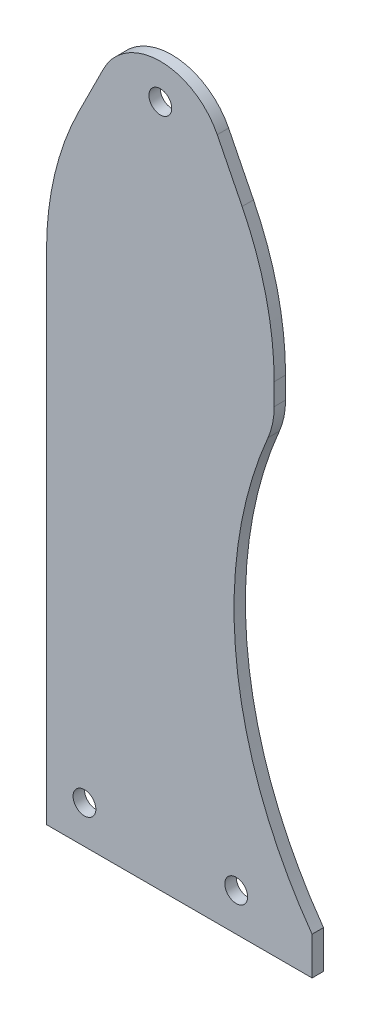
ISO-10303-21;
HEADER;
FILE_DESCRIPTION(('STEP AP214'),'2;1');
FILE_NAME('part.step','',(''),(''),'','','');
FILE_SCHEMA(('AUTOMOTIVE_DESIGN { 1 0 10303 214 1 1 1 1 }'));
ENDSEC;
DATA;
#1=APPLICATION_CONTEXT('core data for automotive mechanical design processes');
#2=APPLICATION_PROTOCOL_DEFINITION('international standard','automotive_design',2000,#1);
#3=PRODUCT_CONTEXT('',#1,'mechanical');
#4=PRODUCT('Part','Part','',(#3));
#5=PRODUCT_RELATED_PRODUCT_CATEGORY('part','',(#4));
#6=PRODUCT_DEFINITION_FORMATION('','',#4);
#7=PRODUCT_DEFINITION_CONTEXT('part definition',#1,'design');
#8=PRODUCT_DEFINITION('design','',#6,#7);
#9=PRODUCT_DEFINITION_SHAPE('','',#8);
#10=(LENGTH_UNIT() NAMED_UNIT(*) SI_UNIT(.MILLI.,.METRE.));
#11=(NAMED_UNIT(*) PLANE_ANGLE_UNIT() SI_UNIT($,.RADIAN.));
#12=(NAMED_UNIT(*) SI_UNIT($,.STERADIAN.) SOLID_ANGLE_UNIT());
#13=UNCERTAINTY_MEASURE_WITH_UNIT(LENGTH_MEASURE(1.E-05),#10,'distance_accuracy_value','');
#14=(GEOMETRIC_REPRESENTATION_CONTEXT(3) GLOBAL_UNCERTAINTY_ASSIGNED_CONTEXT((#13)) GLOBAL_UNIT_ASSIGNED_CONTEXT((#10,
#11,#12)) REPRESENTATION_CONTEXT('',''));
#15=CARTESIAN_POINT('',(0.,0.,0.));
#16=DIRECTION('',(0.,0.,1.));
#17=DIRECTION('',(1.,0.,0.));
#18=AXIS2_PLACEMENT_3D('',#15,#16,#17);
#19=CARTESIAN_POINT('',(-20.,131.114561800017,3.));
#20=DIRECTION('',(0.,0.,1.));
#21=DIRECTION('',(1.,0.,0.));
#22=AXIS2_PLACEMENT_3D('',#19,#20,#21);
#23=PLANE('',#22);
#24=CARTESIAN_POINT('',(50.,10.,3.));
#25=DIRECTION('',(0.,0.,1.));
#26=DIRECTION('',(-1.,0.,0.));
#27=AXIS2_PLACEMENT_3D('',#24,#25,#26);
#28=CIRCLE('',#27,3.);
#29=CARTESIAN_POINT('',(47.,10.,3.));
#30=VERTEX_POINT('',#29);
#31=EDGE_CURVE('E278',#30,#30,#28,.T.);
#32=ORIENTED_EDGE('',*,*,#31,.F.);
#33=EDGE_LOOP('',(#32));
#34=FACE_BOUND('',#33,.T.);
#35=CARTESIAN_POINT('',(-20.,131.114561800017,3.));
#36=DIRECTION('',(0.,0.,1.));
#37=DIRECTION('',(1.,0.,0.));
#38=AXIS2_PLACEMENT_3D('',#35,#36,#37);
#39=CIRCLE('',#38,80.);
#40=CARTESIAN_POINT('',(60.,131.114561800017,3.));
#41=VERTEX_POINT('',#40);
#42=CARTESIAN_POINT('',(51.5541752799933,166.891649440013,3.));
#43=VERTEX_POINT('',#42);
#44=EDGE_CURVE('E176',#41,#43,#39,.T.);
#45=ORIENTED_EDGE('',*,*,#44,.T.);
#46=DIRECTION('',(-0.447213595499959,0.894427190999915,0.));
#47=VECTOR('',#46,1.);
#48=CARTESIAN_POINT('',(51.5541752799933,166.891649440013,3.));
#49=LINE('',#48,#47);
#50=CARTESIAN_POINT('',(45.,180.,3.));
#51=VERTEX_POINT('',#50);
#52=EDGE_CURVE('E107',#43,#51,#49,.T.);
#53=ORIENTED_EDGE('',*,*,#52,.T.);
#54=CARTESIAN_POINT('',(30.,172.5,3.));
#55=DIRECTION('',(0.,0.,1.));
#56=DIRECTION('',(-1.,0.,0.));
#57=AXIS2_PLACEMENT_3D('',#54,#55,#56);
#58=CIRCLE('',#57,16.7705098312484);
#59=CARTESIAN_POINT('',(15.,180.,3.));
#60=VERTEX_POINT('',#59);
#61=EDGE_CURVE('E200',#51,#60,#58,.T.);
#62=ORIENTED_EDGE('',*,*,#61,.T.);
#63=DIRECTION('',(-0.447213595499956,-0.894427190999917,0.));
#64=VECTOR('',#63,1.);
#65=CARTESIAN_POINT('',(8.44582472000673,166.891649440013,3.));
#66=LINE('',#65,#64);
#67=CARTESIAN_POINT('',(8.4458247200067,166.891649440013,3.));
#68=VERTEX_POINT('',#67);
#69=EDGE_CURVE('E218',#60,#68,#66,.T.);
#70=ORIENTED_EDGE('',*,*,#69,.T.);
#71=CARTESIAN_POINT('',(80.,131.114561800017,3.));
#72=DIRECTION('',(0.,0.,1.));
#73=DIRECTION('',(-1.,0.,0.));
#74=AXIS2_PLACEMENT_3D('',#71,#72,#73);
#75=CIRCLE('',#74,80.);
#76=CARTESIAN_POINT('',(0.,131.114561800017,3.));
#77=VERTEX_POINT('',#76);
#78=EDGE_CURVE('E215',#68,#77,#75,.T.);
#79=ORIENTED_EDGE('',*,*,#78,.T.);
#80=DIRECTION('',(0.,-1.,0.));
#81=VECTOR('',#80,1.);
#82=CARTESIAN_POINT('',(0.,131.114561800017,3.));
#83=LINE('',#82,#81);
#84=CARTESIAN_POINT('',(0.,0.,3.));
#85=VERTEX_POINT('',#84);
#86=EDGE_CURVE('E217',#77,#85,#83,.T.);
#87=ORIENTED_EDGE('',*,*,#86,.T.);
#88=DIRECTION('',(1.,0.,0.));
#89=VECTOR('',#88,1.);
#90=CARTESIAN_POINT('',(0.,0.,3.));
#91=LINE('',#90,#89);
#92=CARTESIAN_POINT('',(70.,0.,3.));
#93=VERTEX_POINT('',#92);
#94=EDGE_CURVE('E220',#85,#93,#91,.T.);
#95=ORIENTED_EDGE('',*,*,#94,.T.);
#96=DIRECTION('',(0.,1.,0.));
#97=VECTOR('',#96,1.);
#98=CARTESIAN_POINT('',(70.,0.,3.));
#99=LINE('',#98,#97);
#100=CARTESIAN_POINT('',(70.,9.99999999999995,3.));
#101=VERTEX_POINT('',#100);
#102=EDGE_CURVE('E135',#93,#101,#99,.T.);
#103=ORIENTED_EDGE('',*,*,#102,.T.);
#104=CARTESIAN_POINT('',(159.42548401335,74.0553105447004,3.));
#105=DIRECTION('',(0.,0.,-1.));
#106=DIRECTION('',(-1.,0.,0.));
#107=AXIS2_PLACEMENT_3D('',#104,#105,#106);
#108=CIRCLE('',#107,110.);
#109=CARTESIAN_POINT('',(58.3731513866693,117.511335106395,3.));
#110=VERTEX_POINT('',#109);
#111=EDGE_CURVE('E129',#101,#110,#108,.T.);
#112=ORIENTED_EDGE('',*,*,#111,.T.);
#113=CARTESIAN_POINT('',(40.,125.412430481248,3.));
#114=DIRECTION('',(0.,0.,1.));
#115=DIRECTION('',(1.,0.,0.));
#116=AXIS2_PLACEMENT_3D('',#113,#114,#115);
#117=CIRCLE('',#116,20.);
#118=CARTESIAN_POINT('',(60.,125.412430481248,3.));
#119=VERTEX_POINT('',#118);
#120=EDGE_CURVE('E133',#110,#119,#117,.T.);
#121=ORIENTED_EDGE('',*,*,#120,.T.);
#122=DIRECTION('',(0.,1.,0.));
#123=VECTOR('',#122,1.);
#124=CARTESIAN_POINT('',(60.,131.114561800017,3.));
#125=LINE('',#124,#123);
#126=EDGE_CURVE('E55',#119,#41,#125,.T.);
#127=ORIENTED_EDGE('',*,*,#126,.T.);
#128=EDGE_LOOP('',(#45,#53,#62,#70,#79,#87,#95,#103,#112,#121,#127));
#129=FACE_BOUND('',#128,.T.);
#130=CARTESIAN_POINT('',(10.,10.,3.));
#131=DIRECTION('',(0.,0.,1.));
#132=DIRECTION('',(1.,0.,0.));
#133=AXIS2_PLACEMENT_3D('',#130,#131,#132);
#134=CIRCLE('',#133,3.);
#135=CARTESIAN_POINT('',(13.,10.,3.));
#136=VERTEX_POINT('',#135);
#137=EDGE_CURVE('E157',#136,#136,#134,.T.);
#138=ORIENTED_EDGE('',*,*,#137,.F.);
#139=EDGE_LOOP('',(#138));
#140=FACE_BOUND('',#139,.T.);
#141=CARTESIAN_POINT('',(30.,180.,3.));
#142=DIRECTION('',(0.,0.,1.));
#143=DIRECTION('',(1.,0.,0.));
#144=AXIS2_PLACEMENT_3D('',#141,#142,#143);
#145=CIRCLE('',#144,3.);
#146=CARTESIAN_POINT('',(33.,180.,3.));
#147=VERTEX_POINT('',#146);
#148=EDGE_CURVE('E269',#147,#147,#145,.T.);
#149=ORIENTED_EDGE('',*,*,#148,.F.);
#150=EDGE_LOOP('',(#149));
#151=FACE_BOUND('',#150,.T.);
#152=ADVANCED_FACE('F38',(#34,#129,#140,#151),#23,.T.);
#153=CARTESIAN_POINT('',(-20.,131.114561800017,0.));
#154=DIRECTION('',(0.,0.,1.));
#155=DIRECTION('',(1.,0.,0.));
#156=AXIS2_PLACEMENT_3D('',#153,#154,#155);
#157=PLANE('',#156);
#158=CARTESIAN_POINT('',(50.,10.,0.));
#159=DIRECTION('',(0.,0.,1.));
#160=DIRECTION('',(-1.,0.,0.));
#161=AXIS2_PLACEMENT_3D('',#158,#159,#160);
#162=CIRCLE('',#161,3.);
#163=CARTESIAN_POINT('',(47.,10.,0.));
#164=VERTEX_POINT('',#163);
#165=EDGE_CURVE('E275',#164,#164,#162,.T.);
#166=ORIENTED_EDGE('',*,*,#165,.T.);
#167=EDGE_LOOP('',(#166));
#168=FACE_BOUND('',#167,.T.);
#169=CARTESIAN_POINT('',(-20.,131.114561800017,0.));
#170=DIRECTION('',(0.,0.,1.));
#171=DIRECTION('',(1.,0.,0.));
#172=AXIS2_PLACEMENT_3D('',#169,#170,#171);
#173=CIRCLE('',#172,80.);
#174=CARTESIAN_POINT('',(60.,131.114561800017,0.));
#175=VERTEX_POINT('',#174);
#176=CARTESIAN_POINT('',(51.5541752799933,166.891649440013,0.));
#177=VERTEX_POINT('',#176);
#178=EDGE_CURVE('E153',#175,#177,#173,.T.);
#179=ORIENTED_EDGE('',*,*,#178,.F.);
#180=DIRECTION('',(0.,1.,0.));
#181=VECTOR('',#180,1.);
#182=CARTESIAN_POINT('',(60.,131.114561800017,0.));
#183=LINE('',#182,#181);
#184=CARTESIAN_POINT('',(60.,125.412430481248,0.));
#185=VERTEX_POINT('',#184);
#186=EDGE_CURVE('E99',#185,#175,#183,.T.);
#187=ORIENTED_EDGE('',*,*,#186,.F.);
#188=CARTESIAN_POINT('',(40.,125.412430481248,0.));
#189=DIRECTION('',(0.,0.,1.));
#190=DIRECTION('',(1.,0.,0.));
#191=AXIS2_PLACEMENT_3D('',#188,#189,#190);
#192=CIRCLE('',#191,20.);
#193=CARTESIAN_POINT('',(58.3731513866693,117.511335106395,0.));
#194=VERTEX_POINT('',#193);
#195=EDGE_CURVE('E93',#194,#185,#192,.T.);
#196=ORIENTED_EDGE('',*,*,#195,.F.);
#197=CARTESIAN_POINT('',(159.42548401335,74.0553105447004,0.));
#198=DIRECTION('',(0.,0.,-1.));
#199=DIRECTION('',(-1.,0.,0.));
#200=AXIS2_PLACEMENT_3D('',#197,#198,#199);
#201=CIRCLE('',#200,110.);
#202=CARTESIAN_POINT('',(70.,9.99999999999995,0.));
#203=VERTEX_POINT('',#202);
#204=EDGE_CURVE('E143',#203,#194,#201,.T.);
#205=ORIENTED_EDGE('',*,*,#204,.F.);
#206=DIRECTION('',(0.,1.,0.));
#207=VECTOR('',#206,1.);
#208=CARTESIAN_POINT('',(70.,0.,0.));
#209=LINE('',#208,#207);
#210=CARTESIAN_POINT('',(70.,0.,0.));
#211=VERTEX_POINT('',#210);
#212=EDGE_CURVE('E171',#211,#203,#209,.T.);
#213=ORIENTED_EDGE('',*,*,#212,.F.);
#214=DIRECTION('',(1.,0.,0.));
#215=VECTOR('',#214,1.);
#216=CARTESIAN_POINT('',(60.,0.,0.));
#217=LINE('',#216,#215);
#218=CARTESIAN_POINT('',(0.,0.,0.));
#219=VERTEX_POINT('',#218);
#220=EDGE_CURVE('E169',#219,#211,#217,.T.);
#221=ORIENTED_EDGE('',*,*,#220,.F.);
#222=DIRECTION('',(0.,-1.,0.));
#223=VECTOR('',#222,1.);
#224=CARTESIAN_POINT('',(0.,10.,0.));
#225=LINE('',#224,#223);
#226=CARTESIAN_POINT('',(0.,131.114561800017,0.));
#227=VERTEX_POINT('',#226);
#228=EDGE_CURVE('E166',#227,#219,#225,.T.);
#229=ORIENTED_EDGE('',*,*,#228,.F.);
#230=CARTESIAN_POINT('',(80.,131.114561800017,0.));
#231=DIRECTION('',(0.,0.,1.));
#232=DIRECTION('',(-1.,0.,0.));
#233=AXIS2_PLACEMENT_3D('',#230,#231,#232);
#234=CIRCLE('',#233,80.);
#235=CARTESIAN_POINT('',(8.4458247200067,166.891649440013,0.));
#236=VERTEX_POINT('',#235);
#237=EDGE_CURVE('E163',#236,#227,#234,.T.);
#238=ORIENTED_EDGE('',*,*,#237,.F.);
#239=DIRECTION('',(-0.447213595499956,-0.894427190999917,0.));
#240=VECTOR('',#239,1.);
#241=CARTESIAN_POINT('',(8.44582472000673,166.891649440013,0.));
#242=LINE('',#241,#240);
#243=CARTESIAN_POINT('',(15.,180.,0.));
#244=VERTEX_POINT('',#243);
#245=EDGE_CURVE('E161',#244,#236,#242,.T.);
#246=ORIENTED_EDGE('',*,*,#245,.F.);
#247=CARTESIAN_POINT('',(30.,172.5,0.));
#248=DIRECTION('',(0.,0.,1.));
#249=DIRECTION('',(-1.,0.,0.));
#250=AXIS2_PLACEMENT_3D('',#247,#248,#249);
#251=CIRCLE('',#250,16.7705098312484);
#252=CARTESIAN_POINT('',(45.,180.,0.));
#253=VERTEX_POINT('',#252);
#254=EDGE_CURVE('E159',#253,#244,#251,.T.);
#255=ORIENTED_EDGE('',*,*,#254,.F.);
#256=DIRECTION('',(-0.447213595499959,0.894427190999915,0.));
#257=VECTOR('',#256,1.);
#258=CARTESIAN_POINT('',(51.5541752799933,166.891649440013,0.));
#259=LINE('',#258,#257);
#260=EDGE_CURVE('E156',#177,#253,#259,.T.);
#261=ORIENTED_EDGE('',*,*,#260,.F.);
#262=EDGE_LOOP('',(#179,#187,#196,#205,#213,#221,#229,#238,#246,#255,#261));
#263=FACE_BOUND('',#262,.T.);
#264=CARTESIAN_POINT('',(10.,10.,0.));
#265=DIRECTION('',(0.,0.,1.));
#266=DIRECTION('',(1.,0.,0.));
#267=AXIS2_PLACEMENT_3D('',#264,#265,#266);
#268=CIRCLE('',#267,3.);
#269=CARTESIAN_POINT('',(13.,10.,0.));
#270=VERTEX_POINT('',#269);
#271=EDGE_CURVE('E281',#270,#270,#268,.T.);
#272=ORIENTED_EDGE('',*,*,#271,.T.);
#273=EDGE_LOOP('',(#272));
#274=FACE_BOUND('',#273,.T.);
#275=CARTESIAN_POINT('',(30.,180.,0.));
#276=DIRECTION('',(0.,0.,1.));
#277=DIRECTION('',(1.,0.,0.));
#278=AXIS2_PLACEMENT_3D('',#275,#276,#277);
#279=CIRCLE('',#278,3.);
#280=CARTESIAN_POINT('',(33.,180.,0.));
#281=VERTEX_POINT('',#280);
#282=EDGE_CURVE('E272',#281,#281,#279,.T.);
#283=ORIENTED_EDGE('',*,*,#282,.T.);
#284=EDGE_LOOP('',(#283));
#285=FACE_BOUND('',#284,.T.);
#286=ADVANCED_FACE('F204',(#168,#263,#274,#285),#157,.F.);
#287=CARTESIAN_POINT('',(-20.,131.114561800017,3.));
#288=DIRECTION('',(0.,0.,-1.));
#289=DIRECTION('',(-1.,0.,0.));
#290=AXIS2_PLACEMENT_3D('',#287,#288,#289);
#291=CYLINDRICAL_SURFACE('',#290,80.);
#292=ORIENTED_EDGE('',*,*,#178,.T.);
#293=DIRECTION('',(0.,0.,-1.));
#294=VECTOR('',#293,1.);
#295=CARTESIAN_POINT('',(51.5541752799933,166.891649440013,3.));
#296=LINE('',#295,#294);
#297=EDGE_CURVE('E11',#43,#177,#296,.T.);
#298=ORIENTED_EDGE('',*,*,#297,.F.);
#299=ORIENTED_EDGE('',*,*,#44,.F.);
#300=DIRECTION('',(0.,0.,-1.));
#301=VECTOR('',#300,1.);
#302=CARTESIAN_POINT('',(60.,131.114561800017,3.));
#303=LINE('',#302,#301);
#304=EDGE_CURVE('E149',#41,#175,#303,.T.);
#305=ORIENTED_EDGE('',*,*,#304,.T.);
#306=EDGE_LOOP('',(#292,#298,#299,#305));
#307=FACE_BOUND('',#306,.T.);
#308=ADVANCED_FACE('F40',(#307),#291,.T.);
#309=CARTESIAN_POINT('',(51.5541752799933,166.891649440013,3.));
#310=DIRECTION('',(-0.894427190999916,-0.447213595499959,0.));
#311=DIRECTION('',(0.447213595499959,-0.894427190999916,0.));
#312=AXIS2_PLACEMENT_3D('',#309,#310,#311);
#313=PLANE('',#312);
#314=ORIENTED_EDGE('',*,*,#260,.T.);
#315=DIRECTION('',(0.,0.,-1.));
#316=VECTOR('',#315,1.);
#317=CARTESIAN_POINT('',(45.,180.,3.));
#318=LINE('',#317,#316);
#319=EDGE_CURVE('E47',#51,#253,#318,.T.);
#320=ORIENTED_EDGE('',*,*,#319,.F.);
#321=ORIENTED_EDGE('',*,*,#52,.F.);
#322=ORIENTED_EDGE('',*,*,#297,.T.);
#323=EDGE_LOOP('',(#314,#320,#321,#322));
#324=FACE_BOUND('',#323,.T.);
#325=ADVANCED_FACE('F374',(#324),#313,.F.);
#326=CARTESIAN_POINT('',(30.,172.5,3.));
#327=DIRECTION('',(0.,0.,-1.));
#328=DIRECTION('',(-1.,0.,0.));
#329=AXIS2_PLACEMENT_3D('',#326,#327,#328);
#330=CYLINDRICAL_SURFACE('',#329,16.7705098312484);
#331=ORIENTED_EDGE('',*,*,#254,.T.);
#332=DIRECTION('',(0.,0.,-1.));
#333=VECTOR('',#332,1.);
#334=CARTESIAN_POINT('',(15.,180.,3.));
#335=LINE('',#334,#333);
#336=EDGE_CURVE('E192',#60,#244,#335,.T.);
#337=ORIENTED_EDGE('',*,*,#336,.F.);
#338=ORIENTED_EDGE('',*,*,#61,.F.);
#339=ORIENTED_EDGE('',*,*,#319,.T.);
#340=EDGE_LOOP('',(#331,#337,#338,#339));
#341=FACE_BOUND('',#340,.T.);
#342=ADVANCED_FACE('F198',(#341),#330,.T.);
#343=CARTESIAN_POINT('',(8.44582472000673,166.891649440013,3.));
#344=DIRECTION('',(0.894427190999917,-0.447213595499956,0.));
#345=DIRECTION('',(0.447213595499956,0.894427190999917,0.));
#346=AXIS2_PLACEMENT_3D('',#343,#344,#345);
#347=PLANE('',#346);
#348=ORIENTED_EDGE('',*,*,#245,.T.);
#349=DIRECTION('',(0.,0.,-1.));
#350=VECTOR('',#349,1.);
#351=CARTESIAN_POINT('',(8.4458247200067,166.891649440013,3.));
#352=LINE('',#351,#350);
#353=EDGE_CURVE('E189',#68,#236,#352,.T.);
#354=ORIENTED_EDGE('',*,*,#353,.F.);
#355=ORIENTED_EDGE('',*,*,#69,.F.);
#356=ORIENTED_EDGE('',*,*,#336,.T.);
#357=EDGE_LOOP('',(#348,#354,#355,#356));
#358=FACE_BOUND('',#357,.T.);
#359=ADVANCED_FACE('F209',(#358),#347,.F.);
#360=CARTESIAN_POINT('',(80.,131.114561800017,3.));
#361=DIRECTION('',(0.,0.,-1.));
#362=DIRECTION('',(-1.,0.,0.));
#363=AXIS2_PLACEMENT_3D('',#360,#361,#362);
#364=CYLINDRICAL_SURFACE('',#363,80.);
#365=ORIENTED_EDGE('',*,*,#237,.T.);
#366=DIRECTION('',(0.,0.,-1.));
#367=VECTOR('',#366,1.);
#368=CARTESIAN_POINT('',(0.,131.114561800017,3.));
#369=LINE('',#368,#367);
#370=EDGE_CURVE('E186',#77,#227,#369,.T.);
#371=ORIENTED_EDGE('',*,*,#370,.F.);
#372=ORIENTED_EDGE('',*,*,#78,.F.);
#373=ORIENTED_EDGE('',*,*,#353,.T.);
#374=EDGE_LOOP('',(#365,#371,#372,#373));
#375=FACE_BOUND('',#374,.T.);
#376=ADVANCED_FACE('F213',(#375),#364,.T.);
#377=CARTESIAN_POINT('',(0.,10.,3.));
#378=DIRECTION('',(1.,0.,0.));
#379=DIRECTION('',(0.,0.,-1.));
#380=AXIS2_PLACEMENT_3D('',#377,#378,#379);
#381=PLANE('',#380);
#382=ORIENTED_EDGE('',*,*,#228,.T.);
#383=DIRECTION('',(0.,0.,-1.));
#384=VECTOR('',#383,1.);
#385=CARTESIAN_POINT('',(0.,0.,3.));
#386=LINE('',#385,#384);
#387=EDGE_CURVE('E183',#85,#219,#386,.T.);
#388=ORIENTED_EDGE('',*,*,#387,.F.);
#389=ORIENTED_EDGE('',*,*,#86,.F.);
#390=ORIENTED_EDGE('',*,*,#370,.T.);
#391=EDGE_LOOP('',(#382,#388,#389,#390));
#392=FACE_BOUND('',#391,.T.);
#393=ADVANCED_FACE('F338',(#392),#381,.F.);
#394=CARTESIAN_POINT('',(60.,0.,3.));
#395=DIRECTION('',(0.,1.,0.));
#396=DIRECTION('',(0.,0.,1.));
#397=AXIS2_PLACEMENT_3D('',#394,#395,#396);
#398=PLANE('',#397);
#399=ORIENTED_EDGE('',*,*,#220,.T.);
#400=DIRECTION('',(0.,0.,-1.));
#401=VECTOR('',#400,1.);
#402=CARTESIAN_POINT('',(70.,0.,3.));
#403=LINE('',#402,#401);
#404=EDGE_CURVE('E180',#93,#211,#403,.T.);
#405=ORIENTED_EDGE('',*,*,#404,.F.);
#406=ORIENTED_EDGE('',*,*,#94,.F.);
#407=ORIENTED_EDGE('',*,*,#387,.T.);
#408=EDGE_LOOP('',(#399,#405,#406,#407));
#409=FACE_BOUND('',#408,.T.);
#410=ADVANCED_FACE('F229',(#409),#398,.F.);
#411=CARTESIAN_POINT('',(70.,0.,3.));
#412=DIRECTION('',(-1.,0.,0.));
#413=DIRECTION('',(0.,0.,1.));
#414=AXIS2_PLACEMENT_3D('',#411,#412,#413);
#415=PLANE('',#414);
#416=ORIENTED_EDGE('',*,*,#212,.T.);
#417=DIRECTION('',(0.,0.,-1.));
#418=VECTOR('',#417,1.);
#419=CARTESIAN_POINT('',(70.,9.99999999999995,3.));
#420=LINE('',#419,#418);
#421=EDGE_CURVE('E144',#101,#203,#420,.T.);
#422=ORIENTED_EDGE('',*,*,#421,.F.);
#423=ORIENTED_EDGE('',*,*,#102,.F.);
#424=ORIENTED_EDGE('',*,*,#404,.T.);
#425=EDGE_LOOP('',(#416,#422,#423,#424));
#426=FACE_BOUND('',#425,.T.);
#427=ADVANCED_FACE('F232',(#426),#415,.F.);
#428=CARTESIAN_POINT('',(159.42548401335,74.0553105447004,3.));
#429=DIRECTION('',(0.,0.,-1.));
#430=DIRECTION('',(-1.,0.,0.));
#431=AXIS2_PLACEMENT_3D('',#428,#429,#430);
#432=CYLINDRICAL_SURFACE('',#431,110.);
#433=ORIENTED_EDGE('',*,*,#204,.T.);
#434=DIRECTION('',(0.,0.,-1.));
#435=VECTOR('',#434,1.);
#436=CARTESIAN_POINT('',(58.3731513866693,117.511335106395,3.));
#437=LINE('',#436,#435);
#438=EDGE_CURVE('E140',#110,#194,#437,.T.);
#439=ORIENTED_EDGE('',*,*,#438,.F.);
#440=ORIENTED_EDGE('',*,*,#111,.F.);
#441=ORIENTED_EDGE('',*,*,#421,.T.);
#442=EDGE_LOOP('',(#433,#439,#440,#441));
#443=FACE_BOUND('',#442,.T.);
#444=ADVANCED_FACE('F141',(#443),#432,.F.);
#445=CARTESIAN_POINT('',(40.,125.412430481248,3.));
#446=DIRECTION('',(0.,0.,-1.));
#447=DIRECTION('',(-1.,0.,0.));
#448=AXIS2_PLACEMENT_3D('',#445,#446,#447);
#449=CYLINDRICAL_SURFACE('',#448,20.);
#450=ORIENTED_EDGE('',*,*,#195,.T.);
#451=DIRECTION('',(0.,0.,-1.));
#452=VECTOR('',#451,1.);
#453=CARTESIAN_POINT('',(60.,125.412430481248,3.));
#454=LINE('',#453,#452);
#455=EDGE_CURVE('E145',#119,#185,#454,.T.);
#456=ORIENTED_EDGE('',*,*,#455,.F.);
#457=ORIENTED_EDGE('',*,*,#120,.F.);
#458=ORIENTED_EDGE('',*,*,#438,.T.);
#459=EDGE_LOOP('',(#450,#456,#457,#458));
#460=FACE_BOUND('',#459,.T.);
#461=ADVANCED_FACE('F147',(#460),#449,.T.);
#462=CARTESIAN_POINT('',(60.,131.114561800017,3.));
#463=DIRECTION('',(-1.,0.,0.));
#464=DIRECTION('',(0.,0.,1.));
#465=AXIS2_PLACEMENT_3D('',#462,#463,#464);
#466=PLANE('',#465);
#467=ORIENTED_EDGE('',*,*,#186,.T.);
#468=ORIENTED_EDGE('',*,*,#304,.F.);
#469=ORIENTED_EDGE('',*,*,#126,.F.);
#470=ORIENTED_EDGE('',*,*,#455,.T.);
#471=EDGE_LOOP('',(#467,#468,#469,#470));
#472=FACE_BOUND('',#471,.T.);
#473=ADVANCED_FACE('F236',(#472),#466,.F.);
#474=CARTESIAN_POINT('',(10.,10.,3.));
#475=DIRECTION('',(0.,0.,-1.));
#476=DIRECTION('',(-1.,0.,0.));
#477=AXIS2_PLACEMENT_3D('',#474,#475,#476);
#478=CYLINDRICAL_SURFACE('',#477,3.);
#479=ORIENTED_EDGE('',*,*,#137,.T.);
#480=EDGE_LOOP('',(#479));
#481=FACE_BOUND('',#480,.T.);
#482=ORIENTED_EDGE('',*,*,#271,.F.);
#483=EDGE_LOOP('',(#482));
#484=FACE_BOUND('',#483,.T.);
#485=ADVANCED_FACE('F238',(#481,#484),#478,.F.);
#486=CARTESIAN_POINT('',(50.,10.,3.));
#487=DIRECTION('',(0.,0.,-1.));
#488=DIRECTION('',(-1.,0.,0.));
#489=AXIS2_PLACEMENT_3D('',#486,#487,#488);
#490=CYLINDRICAL_SURFACE('',#489,3.);
#491=ORIENTED_EDGE('',*,*,#31,.T.);
#492=EDGE_LOOP('',(#491));
#493=FACE_BOUND('',#492,.T.);
#494=ORIENTED_EDGE('',*,*,#165,.F.);
#495=EDGE_LOOP('',(#494));
#496=FACE_BOUND('',#495,.T.);
#497=ADVANCED_FACE('F244',(#493,#496),#490,.F.);
#498=CARTESIAN_POINT('',(30.,180.,3.));
#499=DIRECTION('',(0.,0.,-1.));
#500=DIRECTION('',(-1.,0.,0.));
#501=AXIS2_PLACEMENT_3D('',#498,#499,#500);
#502=CYLINDRICAL_SURFACE('',#501,3.);
#503=ORIENTED_EDGE('',*,*,#148,.T.);
#504=EDGE_LOOP('',(#503));
#505=FACE_BOUND('',#504,.T.);
#506=ORIENTED_EDGE('',*,*,#282,.F.);
#507=EDGE_LOOP('',(#506));
#508=FACE_BOUND('',#507,.T.);
#509=ADVANCED_FACE('F260',(#505,#508),#502,.F.);
#510=CLOSED_SHELL('',(#152,#286,#308,#325,#342,#359,#376,#393,#410,#427,#444,#461,#473,#485,
#497,#509));
#511=MANIFOLD_SOLID_BREP('B2',#510);
#512=ADVANCED_BREP_SHAPE_REPRESENTATION('',(#18,#511),#14);
#513=SHAPE_DEFINITION_REPRESENTATION(#9,#512);
ENDSEC;
END-ISO-10303-21;
